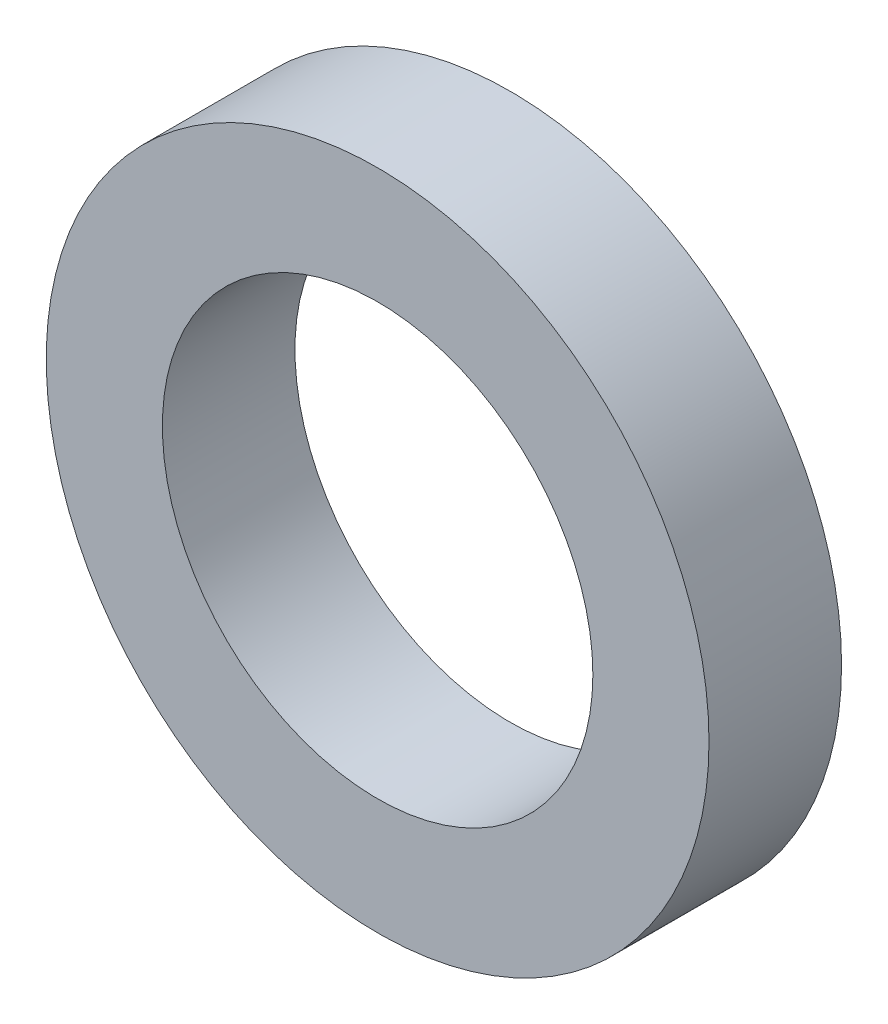
ISO-10303-21;
HEADER;
FILE_DESCRIPTION(('STEP AP214'),'2;1');
FILE_NAME('part.step','',(''),(''),'','','');
FILE_SCHEMA(('AUTOMOTIVE_DESIGN { 1 0 10303 214 1 1 1 1 }'));
ENDSEC;
DATA;
#1=APPLICATION_CONTEXT('core data for automotive mechanical design processes');
#2=APPLICATION_PROTOCOL_DEFINITION('international standard','automotive_design',2000,#1);
#3=PRODUCT_CONTEXT('',#1,'mechanical');
#4=PRODUCT('Part','Part','',(#3));
#5=PRODUCT_RELATED_PRODUCT_CATEGORY('part','',(#4));
#6=PRODUCT_DEFINITION_FORMATION('','',#4);
#7=PRODUCT_DEFINITION_CONTEXT('part definition',#1,'design');
#8=PRODUCT_DEFINITION('design','',#6,#7);
#9=PRODUCT_DEFINITION_SHAPE('','',#8);
#10=(LENGTH_UNIT() NAMED_UNIT(*) SI_UNIT(.MILLI.,.METRE.));
#11=(NAMED_UNIT(*) PLANE_ANGLE_UNIT() SI_UNIT($,.RADIAN.));
#12=(NAMED_UNIT(*) SI_UNIT($,.STERADIAN.) SOLID_ANGLE_UNIT());
#13=UNCERTAINTY_MEASURE_WITH_UNIT(LENGTH_MEASURE(1.E-05),#10,'distance_accuracy_value','');
#14=(GEOMETRIC_REPRESENTATION_CONTEXT(3) GLOBAL_UNCERTAINTY_ASSIGNED_CONTEXT((#13)) GLOBAL_UNIT_ASSIGNED_CONTEXT((#10,
#11,#12)) REPRESENTATION_CONTEXT('',''));
#15=CARTESIAN_POINT('',(0.,0.,0.));
#16=DIRECTION('',(0.,0.,1.));
#17=DIRECTION('',(1.,0.,0.));
#18=AXIS2_PLACEMENT_3D('',#15,#16,#17);
#19=CARTESIAN_POINT('',(0.,0.,2.));
#20=DIRECTION('',(0.,0.,1.));
#21=DIRECTION('',(1.,0.,0.));
#22=AXIS2_PLACEMENT_3D('',#19,#20,#21);
#23=PLANE('',#22);
#24=CARTESIAN_POINT('',(0.,0.,2.));
#25=DIRECTION('',(0.,0.,1.));
#26=DIRECTION('',(1.,0.,0.));
#27=AXIS2_PLACEMENT_3D('',#24,#25,#26);
#28=CIRCLE('',#27,5.);
#29=CARTESIAN_POINT('',(5.,0.,2.));
#30=VERTEX_POINT('',#29);
#31=EDGE_CURVE('E10',#30,#30,#28,.T.);
#32=ORIENTED_EDGE('',*,*,#31,.T.);
#33=EDGE_LOOP('',(#32));
#34=FACE_BOUND('',#33,.T.);
#35=CARTESIAN_POINT('',(0.,0.,2.));
#36=DIRECTION('',(0.,0.,1.));
#37=DIRECTION('',(1.,0.,0.));
#38=AXIS2_PLACEMENT_3D('',#35,#36,#37);
#39=CIRCLE('',#38,3.24759526419165);
#40=CARTESIAN_POINT('',(3.24759526419165,0.,2.));
#41=VERTEX_POINT('',#40);
#42=EDGE_CURVE('E46',#41,#41,#39,.T.);
#43=ORIENTED_EDGE('',*,*,#42,.F.);
#44=EDGE_LOOP('',(#43));
#45=FACE_BOUND('',#44,.T.);
#46=ADVANCED_FACE('F35',(#34,#45),#23,.T.);
#47=CARTESIAN_POINT('',(0.,0.,0.));
#48=DIRECTION('',(0.,0.,1.));
#49=DIRECTION('',(1.,0.,0.));
#50=AXIS2_PLACEMENT_3D('',#47,#48,#49);
#51=PLANE('',#50);
#52=CARTESIAN_POINT('',(0.,0.,0.));
#53=DIRECTION('',(0.,0.,1.));
#54=DIRECTION('',(1.,0.,0.));
#55=AXIS2_PLACEMENT_3D('',#52,#53,#54);
#56=CIRCLE('',#55,5.);
#57=CARTESIAN_POINT('',(5.,0.,0.));
#58=VERTEX_POINT('',#57);
#59=EDGE_CURVE('E39',#58,#58,#56,.T.);
#60=ORIENTED_EDGE('',*,*,#59,.F.);
#61=EDGE_LOOP('',(#60));
#62=FACE_BOUND('',#61,.T.);
#63=CARTESIAN_POINT('',(0.,0.,0.));
#64=DIRECTION('',(0.,0.,1.));
#65=DIRECTION('',(1.,0.,0.));
#66=AXIS2_PLACEMENT_3D('',#63,#64,#65);
#67=CIRCLE('',#66,3.24759526419165);
#68=CARTESIAN_POINT('',(3.24759526419165,0.,0.));
#69=VERTEX_POINT('',#68);
#70=EDGE_CURVE('E48',#69,#69,#67,.T.);
#71=ORIENTED_EDGE('',*,*,#70,.T.);
#72=EDGE_LOOP('',(#71));
#73=FACE_BOUND('',#72,.T.);
#74=ADVANCED_FACE('F58',(#62,#73),#51,.F.);
#75=CARTESIAN_POINT('',(0.,0.,2.));
#76=DIRECTION('',(0.,0.,-1.));
#77=DIRECTION('',(-1.,0.,0.));
#78=AXIS2_PLACEMENT_3D('',#75,#76,#77);
#79=CYLINDRICAL_SURFACE('',#78,5.);
#80=ORIENTED_EDGE('',*,*,#31,.F.);
#81=EDGE_LOOP('',(#80));
#82=FACE_BOUND('',#81,.T.);
#83=ORIENTED_EDGE('',*,*,#59,.T.);
#84=EDGE_LOOP('',(#83));
#85=FACE_BOUND('',#84,.T.);
#86=ADVANCED_FACE('F37',(#82,#85),#79,.T.);
#87=CARTESIAN_POINT('',(0.,0.,2.));
#88=DIRECTION('',(0.,0.,-1.));
#89=DIRECTION('',(-1.,0.,0.));
#90=AXIS2_PLACEMENT_3D('',#87,#88,#89);
#91=CYLINDRICAL_SURFACE('',#90,3.24759526419165);
#92=ORIENTED_EDGE('',*,*,#42,.T.);
#93=EDGE_LOOP('',(#92));
#94=FACE_BOUND('',#93,.T.);
#95=ORIENTED_EDGE('',*,*,#70,.F.);
#96=EDGE_LOOP('',(#95));
#97=FACE_BOUND('',#96,.T.);
#98=ADVANCED_FACE('F54',(#94,#97),#91,.F.);
#99=CLOSED_SHELL('',(#46,#74,#86,#98));
#100=MANIFOLD_SOLID_BREP('B2',#99);
#101=ADVANCED_BREP_SHAPE_REPRESENTATION('',(#18,#100),#14);
#102=SHAPE_DEFINITION_REPRESENTATION(#9,#101);
ENDSEC;
END-ISO-10303-21;
